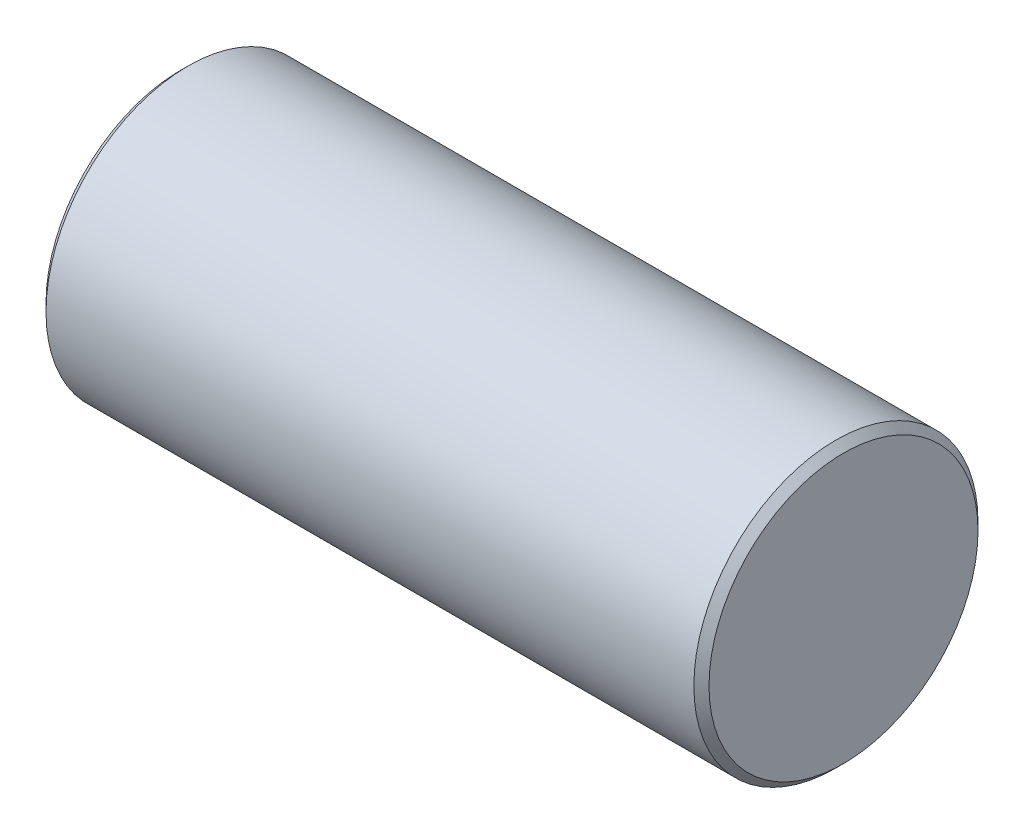
ISO-10303-21;
HEADER;
FILE_DESCRIPTION(('STEP AP214'),'2;1');
FILE_NAME('part.step','',(''),(''),'','','');
FILE_SCHEMA(('AUTOMOTIVE_DESIGN { 1 0 10303 214 1 1 1 1 }'));
ENDSEC;
DATA;
#1=APPLICATION_CONTEXT('core data for automotive mechanical design processes');
#2=APPLICATION_PROTOCOL_DEFINITION('international standard','automotive_design',2000,#1);
#3=PRODUCT_CONTEXT('',#1,'mechanical');
#4=PRODUCT('Part','Part','',(#3));
#5=PRODUCT_RELATED_PRODUCT_CATEGORY('part','',(#4));
#6=PRODUCT_DEFINITION_FORMATION('','',#4);
#7=PRODUCT_DEFINITION_CONTEXT('part definition',#1,'design');
#8=PRODUCT_DEFINITION('design','',#6,#7);
#9=PRODUCT_DEFINITION_SHAPE('','',#8);
#10=(LENGTH_UNIT() NAMED_UNIT(*) SI_UNIT(.MILLI.,.METRE.));
#11=(NAMED_UNIT(*) PLANE_ANGLE_UNIT() SI_UNIT($,.RADIAN.));
#12=(NAMED_UNIT(*) SI_UNIT($,.STERADIAN.) SOLID_ANGLE_UNIT());
#13=UNCERTAINTY_MEASURE_WITH_UNIT(LENGTH_MEASURE(1.E-05),#10,'distance_accuracy_value','');
#14=(GEOMETRIC_REPRESENTATION_CONTEXT(3) GLOBAL_UNCERTAINTY_ASSIGNED_CONTEXT((#13)) GLOBAL_UNIT_ASSIGNED_CONTEXT((#10,
#11,#12)) REPRESENTATION_CONTEXT('',''));
#15=CARTESIAN_POINT('',(0.,0.,0.));
#16=DIRECTION('',(0.,0.,1.));
#17=DIRECTION('',(1.,0.,0.));
#18=AXIS2_PLACEMENT_3D('',#15,#16,#17);
#19=CARTESIAN_POINT('',(11.1125,0.,0.));
#20=DIRECTION('',(-1.,0.,0.));
#21=DIRECTION('',(0.,0.,1.));
#22=AXIS2_PLACEMENT_3D('',#19,#20,#21);
#23=CYLINDRICAL_SURFACE('',#22,4.7625);
#24=CARTESIAN_POINT('',(-10.8585,0.,0.));
#25=DIRECTION('',(1.,0.,0.));
#26=DIRECTION('',(0.,0.,-1.));
#27=AXIS2_PLACEMENT_3D('',#24,#25,#26);
#28=CIRCLE('',#27,4.7625);
#29=CARTESIAN_POINT('',(-10.8585,0.,-4.7625));
#30=VERTEX_POINT('',#29);
#31=EDGE_CURVE('E116',#30,#30,#28,.T.);
#32=ORIENTED_EDGE('',*,*,#31,.T.);
#33=EDGE_LOOP('',(#32));
#34=FACE_BOUND('',#33,.T.);
#35=CARTESIAN_POINT('',(10.8585,0.,0.));
#36=DIRECTION('',(1.,0.,0.));
#37=DIRECTION('',(0.,0.,-1.));
#38=AXIS2_PLACEMENT_3D('',#35,#36,#37);
#39=CIRCLE('',#38,4.7625);
#40=CARTESIAN_POINT('',(10.8585,0.,-4.7625));
#41=VERTEX_POINT('',#40);
#42=EDGE_CURVE('E112',#41,#41,#39,.F.);
#43=ORIENTED_EDGE('',*,*,#42,.T.);
#44=EDGE_LOOP('',(#43));
#45=FACE_BOUND('',#44,.T.);
#46=CARTESIAN_POINT('',(4.1275,0.,0.));
#47=DIRECTION('',(1.,0.,0.));
#48=DIRECTION('',(0.,0.,-1.));
#49=AXIS2_PLACEMENT_3D('',#46,#47,#48);
#50=CIRCLE('',#49,4.7625);
#51=CARTESIAN_POINT('',(4.1275,-2.1402420423868,-4.2545));
#52=VERTEX_POINT('',#51);
#53=CARTESIAN_POINT('',(4.1275,2.14024204238679,-4.2545));
#54=VERTEX_POINT('',#53);
#55=EDGE_CURVE('E103',#52,#54,#50,.T.);
#56=ORIENTED_EDGE('',*,*,#55,.T.);
#57=DIRECTION('',(-1.,0.,0.));
#58=VECTOR('',#57,1.);
#59=CARTESIAN_POINT('',(11.1125,2.14024204238679,-4.2545));
#60=LINE('',#59,#58);
#61=CARTESIAN_POINT('',(-4.1275,2.14024204238679,-4.2545));
#62=VERTEX_POINT('',#61);
#63=EDGE_CURVE('E108',#62,#54,#60,.F.);
#64=ORIENTED_EDGE('',*,*,#63,.F.);
#65=CARTESIAN_POINT('',(-4.1275,0.,0.));
#66=DIRECTION('',(-1.,0.,0.));
#67=DIRECTION('',(0.,0.,1.));
#68=AXIS2_PLACEMENT_3D('',#65,#66,#67);
#69=CIRCLE('',#68,4.7625);
#70=CARTESIAN_POINT('',(-4.1275,-2.1402420423868,-4.2545));
#71=VERTEX_POINT('',#70);
#72=EDGE_CURVE('E58',#62,#71,#69,.T.);
#73=ORIENTED_EDGE('',*,*,#72,.T.);
#74=DIRECTION('',(-1.,0.,0.));
#75=VECTOR('',#74,1.);
#76=CARTESIAN_POINT('',(11.1125,-2.14024204238679,-4.2545));
#77=LINE('',#76,#75);
#78=EDGE_CURVE('E66',#52,#71,#77,.T.);
#79=ORIENTED_EDGE('',*,*,#78,.F.);
#80=EDGE_LOOP('',(#56,#64,#73,#79));
#81=FACE_BOUND('',#80,.T.);
#82=ADVANCED_FACE('F40',(#34,#45,#81),#23,.T.);
#83=CARTESIAN_POINT('',(11.1125,0.,0.));
#84=DIRECTION('',(1.,0.,0.));
#85=DIRECTION('',(0.,0.,-1.));
#86=AXIS2_PLACEMENT_3D('',#83,#84,#85);
#87=PLANE('',#86);
#88=CARTESIAN_POINT('',(11.1125,0.,0.));
#89=DIRECTION('',(1.,0.,0.));
#90=DIRECTION('',(0.,0.,-1.));
#91=AXIS2_PLACEMENT_3D('',#88,#89,#90);
#92=CIRCLE('',#91,4.5085);
#93=CARTESIAN_POINT('',(11.1125,0.,-4.5085));
#94=VERTEX_POINT('',#93);
#95=EDGE_CURVE('E11',#94,#94,#92,.T.);
#96=ORIENTED_EDGE('',*,*,#95,.T.);
#97=EDGE_LOOP('',(#96));
#98=FACE_BOUND('',#97,.T.);
#99=ADVANCED_FACE('F131',(#98),#87,.T.);
#100=CARTESIAN_POINT('',(-11.1125,0.,0.));
#101=DIRECTION('',(1.,0.,0.));
#102=DIRECTION('',(0.,0.,-1.));
#103=AXIS2_PLACEMENT_3D('',#100,#101,#102);
#104=PLANE('',#103);
#105=CARTESIAN_POINT('',(-11.1125,0.,0.));
#106=DIRECTION('',(1.,0.,0.));
#107=DIRECTION('',(0.,0.,-1.));
#108=AXIS2_PLACEMENT_3D('',#105,#106,#107);
#109=CIRCLE('',#108,4.5085);
#110=CARTESIAN_POINT('',(-11.1125,0.,-4.5085));
#111=VERTEX_POINT('',#110);
#112=EDGE_CURVE('E49',#111,#111,#109,.F.);
#113=ORIENTED_EDGE('',*,*,#112,.T.);
#114=EDGE_LOOP('',(#113));
#115=FACE_BOUND('',#114,.T.);
#116=ADVANCED_FACE('F122',(#115),#104,.F.);
#117=CARTESIAN_POINT('',(4.1275,-4.7625,-4.2545));
#118=DIRECTION('',(1.,0.,0.));
#119=DIRECTION('',(0.,0.,-1.));
#120=AXIS2_PLACEMENT_3D('',#117,#118,#119);
#121=PLANE('',#120);
#122=ORIENTED_EDGE('',*,*,#55,.F.);
#123=DIRECTION('',(0.,-1.,0.));
#124=VECTOR('',#123,1.);
#125=CARTESIAN_POINT('',(4.1275,-4.7625,-4.2545));
#126=LINE('',#125,#124);
#127=EDGE_CURVE('E88',#54,#52,#126,.T.);
#128=ORIENTED_EDGE('',*,*,#127,.F.);
#129=EDGE_LOOP('',(#122,#128));
#130=FACE_BOUND('',#129,.T.);
#131=ADVANCED_FACE('F138',(#130),#121,.F.);
#132=CARTESIAN_POINT('',(-4.1275,-4.7625,-4.2545));
#133=DIRECTION('',(-1.,0.,0.));
#134=DIRECTION('',(0.,0.,1.));
#135=AXIS2_PLACEMENT_3D('',#132,#133,#134);
#136=PLANE('',#135);
#137=DIRECTION('',(0.,1.,0.));
#138=VECTOR('',#137,1.);
#139=CARTESIAN_POINT('',(-4.1275,-4.7625,-4.2545));
#140=LINE('',#139,#138);
#141=EDGE_CURVE('E94',#71,#62,#140,.T.);
#142=ORIENTED_EDGE('',*,*,#141,.F.);
#143=ORIENTED_EDGE('',*,*,#72,.F.);
#144=EDGE_LOOP('',(#142,#143));
#145=FACE_BOUND('',#144,.T.);
#146=ADVANCED_FACE('F140',(#145),#136,.F.);
#147=CARTESIAN_POINT('',(0.,0.,-4.2545));
#148=DIRECTION('',(0.,0.,-1.));
#149=DIRECTION('',(-1.,0.,0.));
#150=AXIS2_PLACEMENT_3D('',#147,#148,#149);
#151=PLANE('',#150);
#152=CARTESIAN_POINT('',(0.,0.,-4.2545));
#153=DIRECTION('',(0.,0.,-1.));
#154=DIRECTION('',(-1.,0.,0.));
#155=AXIS2_PLACEMENT_3D('',#152,#153,#154);
#156=CIRCLE('',#155,1.13029999999999);
#157=CARTESIAN_POINT('',(-1.13029999999999,0.,-4.2545));
#158=VERTEX_POINT('',#157);
#159=EDGE_CURVE('E89',#158,#158,#156,.T.);
#160=ORIENTED_EDGE('',*,*,#159,.F.);
#161=EDGE_LOOP('',(#160));
#162=FACE_BOUND('',#161,.T.);
#163=ORIENTED_EDGE('',*,*,#78,.T.);
#164=ORIENTED_EDGE('',*,*,#141,.T.);
#165=ORIENTED_EDGE('',*,*,#63,.T.);
#166=ORIENTED_EDGE('',*,*,#127,.T.);
#167=EDGE_LOOP('',(#163,#164,#165,#166));
#168=FACE_BOUND('',#167,.T.);
#169=ADVANCED_FACE('F81',(#162,#168),#151,.T.);
#170=CARTESIAN_POINT('',(0.,0.,-0.444500000000001));
#171=DIRECTION('',(0.,0.,-1.));
#172=DIRECTION('',(-1.,0.,0.));
#173=AXIS2_PLACEMENT_3D('',#170,#171,#172);
#174=CONICAL_SURFACE('',#173,1.1303,1.02974425867665);
#175=CARTESIAN_POINT('',(0.,0.,0.234652757686851));
#176=VERTEX_POINT('',#175);
#177=VERTEX_LOOP('',#176);
#178=FACE_BOUND('',#177,.T.);
#179=CARTESIAN_POINT('',(0.,0.,-0.444500000000001));
#180=DIRECTION('',(0.,0.,-1.));
#181=DIRECTION('',(-1.,0.,0.));
#182=AXIS2_PLACEMENT_3D('',#179,#180,#181);
#183=CIRCLE('',#182,1.1303);
#184=CARTESIAN_POINT('',(-1.1303,0.,-0.444500000000001));
#185=VERTEX_POINT('',#184);
#186=EDGE_CURVE('E85',#185,#185,#183,.T.);
#187=ORIENTED_EDGE('',*,*,#186,.T.);
#188=EDGE_LOOP('',(#187));
#189=FACE_BOUND('',#188,.T.);
#190=ADVANCED_FACE('F77',(#178,#189),#174,.F.);
#191=CARTESIAN_POINT('',(0.,0.,-4.2545));
#192=DIRECTION('',(0.,0.,-1.));
#193=DIRECTION('',(-1.,0.,0.));
#194=AXIS2_PLACEMENT_3D('',#191,#192,#193);
#195=CYLINDRICAL_SURFACE('',#194,1.13029999999999);
#196=ORIENTED_EDGE('',*,*,#186,.F.);
#197=EDGE_LOOP('',(#196));
#198=FACE_BOUND('',#197,.T.);
#199=ORIENTED_EDGE('',*,*,#159,.T.);
#200=EDGE_LOOP('',(#199));
#201=FACE_BOUND('',#200,.T.);
#202=ADVANCED_FACE('F80',(#198,#201),#195,.F.);
#203=CARTESIAN_POINT('',(-10.8585,0.,0.));
#204=DIRECTION('',(1.,0.,0.));
#205=DIRECTION('',(0.,0.,-1.));
#206=AXIS2_PLACEMENT_3D('',#203,#204,#205);
#207=CONICAL_SURFACE('',#206,4.7625,0.785398163397453);
#208=ORIENTED_EDGE('',*,*,#112,.F.);
#209=EDGE_LOOP('',(#208));
#210=FACE_BOUND('',#209,.T.);
#211=ORIENTED_EDGE('',*,*,#31,.F.);
#212=EDGE_LOOP('',(#211));
#213=FACE_BOUND('',#212,.T.);
#214=ADVANCED_FACE('F124',(#210,#213),#207,.T.);
#215=CARTESIAN_POINT('',(11.1125,0.,0.));
#216=DIRECTION('',(-1.,0.,0.));
#217=DIRECTION('',(0.,0.,1.));
#218=AXIS2_PLACEMENT_3D('',#215,#216,#217);
#219=CONICAL_SURFACE('',#218,4.5085,0.785398163397453);
#220=ORIENTED_EDGE('',*,*,#42,.F.);
#221=EDGE_LOOP('',(#220));
#222=FACE_BOUND('',#221,.T.);
#223=ORIENTED_EDGE('',*,*,#95,.F.);
#224=EDGE_LOOP('',(#223));
#225=FACE_BOUND('',#224,.T.);
#226=ADVANCED_FACE('F42',(#222,#225),#219,.T.);
#227=CLOSED_SHELL('',(#82,#99,#116,#131,#146,#169,#190,#202,#214,#226));
#228=MANIFOLD_SOLID_BREP('B2',#227);
#229=ADVANCED_BREP_SHAPE_REPRESENTATION('',(#18,#228),#14);
#230=SHAPE_DEFINITION_REPRESENTATION(#9,#229);
ENDSEC;
END-ISO-10303-21;
